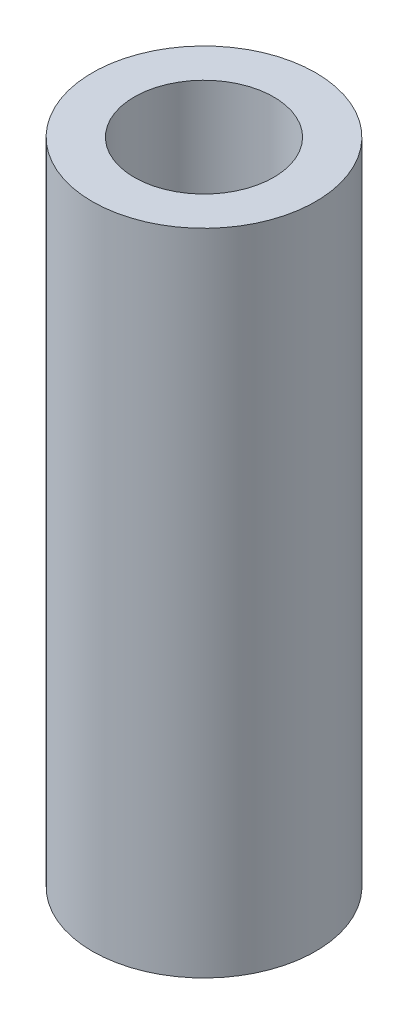
ISO-10303-21;
HEADER;
FILE_DESCRIPTION(('STEP AP214'),'2;1');
FILE_NAME('part.step','',(''),(''),'','','');
FILE_SCHEMA(('AUTOMOTIVE_DESIGN { 1 0 10303 214 1 1 1 1 }'));
ENDSEC;
DATA;
#1=APPLICATION_CONTEXT('core data for automotive mechanical design processes');
#2=APPLICATION_PROTOCOL_DEFINITION('international standard','automotive_design',2000,#1);
#3=PRODUCT_CONTEXT('',#1,'mechanical');
#4=PRODUCT('Part','Part','',(#3));
#5=PRODUCT_RELATED_PRODUCT_CATEGORY('part','',(#4));
#6=PRODUCT_DEFINITION_FORMATION('','',#4);
#7=PRODUCT_DEFINITION_CONTEXT('part definition',#1,'design');
#8=PRODUCT_DEFINITION('design','',#6,#7);
#9=PRODUCT_DEFINITION_SHAPE('','',#8);
#10=(LENGTH_UNIT() NAMED_UNIT(*) SI_UNIT(.MILLI.,.METRE.));
#11=(NAMED_UNIT(*) PLANE_ANGLE_UNIT() SI_UNIT($,.RADIAN.));
#12=(NAMED_UNIT(*) SI_UNIT($,.STERADIAN.) SOLID_ANGLE_UNIT());
#13=UNCERTAINTY_MEASURE_WITH_UNIT(LENGTH_MEASURE(1.E-05),#10,'distance_accuracy_value','');
#14=(GEOMETRIC_REPRESENTATION_CONTEXT(3) GLOBAL_UNCERTAINTY_ASSIGNED_CONTEXT((#13)) GLOBAL_UNIT_ASSIGNED_CONTEXT((#10,
#11,#12)) REPRESENTATION_CONTEXT('',''));
#15=CARTESIAN_POINT('',(0.,0.,0.));
#16=DIRECTION('',(0.,0.,1.));
#17=DIRECTION('',(1.,0.,0.));
#18=AXIS2_PLACEMENT_3D('',#15,#16,#17);
#19=CARTESIAN_POINT('',(0.,87.2171912385471,0.));
#20=DIRECTION('',(0.,-1.,0.));
#21=DIRECTION('',(0.,0.,-1.));
#22=AXIS2_PLACEMENT_3D('',#19,#20,#21);
#23=CYLINDRICAL_SURFACE('',#22,15.);
#24=CARTESIAN_POINT('',(0.,87.2171912385471,0.));
#25=DIRECTION('',(0.,1.,0.));
#26=DIRECTION('',(0.,0.,1.));
#27=AXIS2_PLACEMENT_3D('',#24,#25,#26);
#28=CIRCLE('',#27,15.);
#29=CARTESIAN_POINT('',(0.,87.2171912385471,15.));
#30=VERTEX_POINT('',#29);
#31=EDGE_CURVE('E10',#30,#30,#28,.T.);
#32=ORIENTED_EDGE('',*,*,#31,.F.);
#33=EDGE_LOOP('',(#32));
#34=FACE_BOUND('',#33,.T.);
#35=CARTESIAN_POINT('',(0.,0.,0.));
#36=DIRECTION('',(0.,1.,0.));
#37=DIRECTION('',(0.,0.,1.));
#38=AXIS2_PLACEMENT_3D('',#35,#36,#37);
#39=CIRCLE('',#38,15.);
#40=CARTESIAN_POINT('',(0.,0.,15.));
#41=VERTEX_POINT('',#40);
#42=EDGE_CURVE('E37',#41,#41,#39,.T.);
#43=ORIENTED_EDGE('',*,*,#42,.T.);
#44=EDGE_LOOP('',(#43));
#45=FACE_BOUND('',#44,.T.);
#46=ADVANCED_FACE('F40',(#34,#45),#23,.T.);
#47=CARTESIAN_POINT('',(0.,87.2171912385471,0.));
#48=DIRECTION('',(0.,1.,0.));
#49=DIRECTION('',(0.,0.,1.));
#50=AXIS2_PLACEMENT_3D('',#47,#48,#49);
#51=PLANE('',#50);
#52=CARTESIAN_POINT('',(0.,87.2171912385471,0.));
#53=DIRECTION('',(0.,1.,0.));
#54=DIRECTION('',(0.,0.,1.));
#55=AXIS2_PLACEMENT_3D('',#52,#53,#54);
#56=CIRCLE('',#55,9.36669763979915);
#57=CARTESIAN_POINT('',(0.,87.2171912385471,9.36669763979915));
#58=VERTEX_POINT('',#57);
#59=EDGE_CURVE('E50',#58,#58,#56,.T.);
#60=ORIENTED_EDGE('',*,*,#59,.F.);
#61=EDGE_LOOP('',(#60));
#62=FACE_BOUND('',#61,.T.);
#63=ORIENTED_EDGE('',*,*,#31,.T.);
#64=EDGE_LOOP('',(#63));
#65=FACE_BOUND('',#64,.T.);
#66=ADVANCED_FACE('F59',(#62,#65),#51,.T.);
#67=CARTESIAN_POINT('',(0.,0.,0.));
#68=DIRECTION('',(0.,1.,0.));
#69=DIRECTION('',(0.,0.,1.));
#70=AXIS2_PLACEMENT_3D('',#67,#68,#69);
#71=PLANE('',#70);
#72=CARTESIAN_POINT('',(0.,0.,0.));
#73=DIRECTION('',(0.,1.,0.));
#74=DIRECTION('',(0.,0.,1.));
#75=AXIS2_PLACEMENT_3D('',#72,#73,#74);
#76=CIRCLE('',#75,9.36669763979915);
#77=CARTESIAN_POINT('',(0.,0.,9.36669763979915));
#78=VERTEX_POINT('',#77);
#79=EDGE_CURVE('E47',#78,#78,#76,.T.);
#80=ORIENTED_EDGE('',*,*,#79,.T.);
#81=EDGE_LOOP('',(#80));
#82=FACE_BOUND('',#81,.T.);
#83=ORIENTED_EDGE('',*,*,#42,.F.);
#84=EDGE_LOOP('',(#83));
#85=FACE_BOUND('',#84,.T.);
#86=ADVANCED_FACE('F58',(#82,#85),#71,.F.);
#87=CARTESIAN_POINT('',(0.,87.2171912385471,0.));
#88=DIRECTION('',(0.,-1.,0.));
#89=DIRECTION('',(0.,0.,-1.));
#90=AXIS2_PLACEMENT_3D('',#87,#88,#89);
#91=CYLINDRICAL_SURFACE('',#90,9.36669763979915);
#92=ORIENTED_EDGE('',*,*,#59,.T.);
#93=EDGE_LOOP('',(#92));
#94=FACE_BOUND('',#93,.T.);
#95=ORIENTED_EDGE('',*,*,#79,.F.);
#96=EDGE_LOOP('',(#95));
#97=FACE_BOUND('',#96,.T.);
#98=ADVANCED_FACE('F54',(#94,#97),#91,.F.);
#99=CLOSED_SHELL('',(#46,#66,#86,#98));
#100=MANIFOLD_SOLID_BREP('B2',#99);
#101=ADVANCED_BREP_SHAPE_REPRESENTATION('',(#18,#100),#14);
#102=SHAPE_DEFINITION_REPRESENTATION(#9,#101);
ENDSEC;
END-ISO-10303-21;
